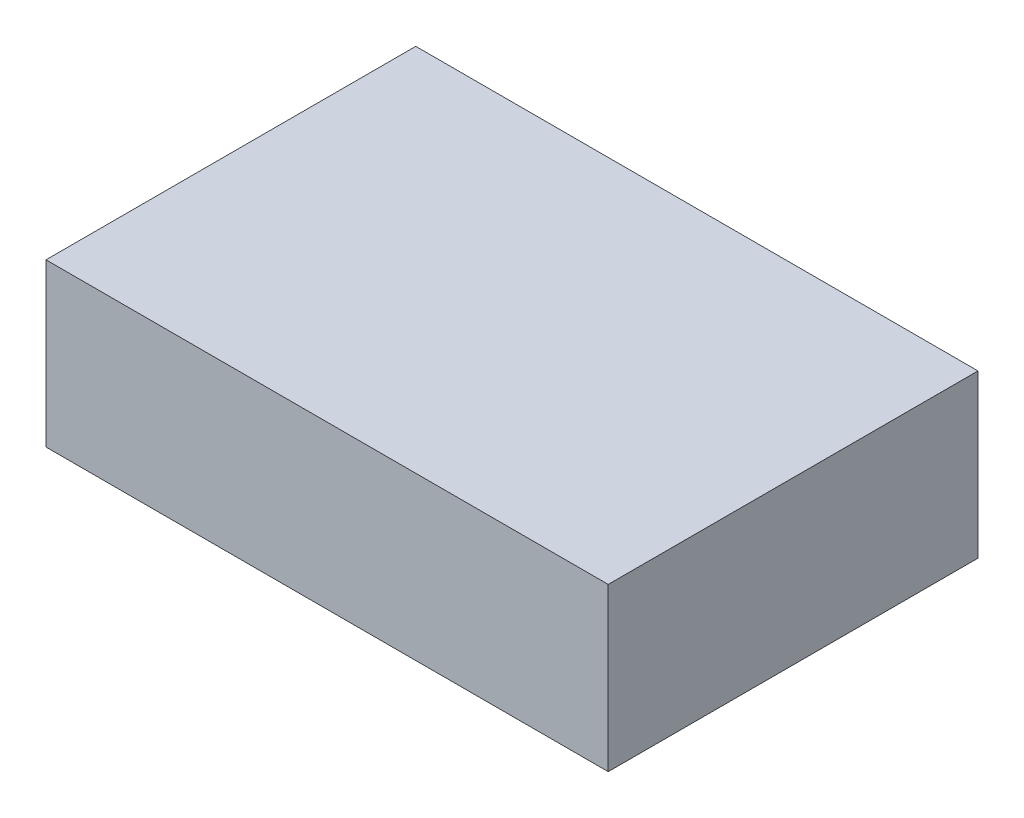
ISO-10303-21;
HEADER;
FILE_DESCRIPTION(('STEP AP214'),'2;1');
FILE_NAME('part.step','',(''),(''),'','','');
FILE_SCHEMA(('AUTOMOTIVE_DESIGN { 1 0 10303 214 1 1 1 1 }'));
ENDSEC;
DATA;
#1=APPLICATION_CONTEXT('core data for automotive mechanical design processes');
#2=APPLICATION_PROTOCOL_DEFINITION('international standard','automotive_design',2000,#1);
#3=PRODUCT_CONTEXT('',#1,'mechanical');
#4=PRODUCT('Part','Part','',(#3));
#5=PRODUCT_RELATED_PRODUCT_CATEGORY('part','',(#4));
#6=PRODUCT_DEFINITION_FORMATION('','',#4);
#7=PRODUCT_DEFINITION_CONTEXT('part definition',#1,'design');
#8=PRODUCT_DEFINITION('design','',#6,#7);
#9=PRODUCT_DEFINITION_SHAPE('','',#8);
#10=(LENGTH_UNIT() NAMED_UNIT(*) SI_UNIT(.MILLI.,.METRE.));
#11=(NAMED_UNIT(*) PLANE_ANGLE_UNIT() SI_UNIT($,.RADIAN.));
#12=(NAMED_UNIT(*) SI_UNIT($,.STERADIAN.) SOLID_ANGLE_UNIT());
#13=UNCERTAINTY_MEASURE_WITH_UNIT(LENGTH_MEASURE(1.E-05),#10,'distance_accuracy_value','');
#14=(GEOMETRIC_REPRESENTATION_CONTEXT(3) GLOBAL_UNCERTAINTY_ASSIGNED_CONTEXT((#13)) GLOBAL_UNIT_ASSIGNED_CONTEXT((#10,
#11,#12)) REPRESENTATION_CONTEXT('',''));
#15=CARTESIAN_POINT('',(0.,0.,0.));
#16=DIRECTION('',(0.,0.,1.));
#17=DIRECTION('',(1.,0.,0.));
#18=AXIS2_PLACEMENT_3D('',#15,#16,#17);
#19=CARTESIAN_POINT('',(-0.65000124,0.18750026,0.));
#20=DIRECTION('',(0.,1.,0.));
#21=DIRECTION('',(0.,0.,1.));
#22=AXIS2_PLACEMENT_3D('',#19,#20,#21);
#23=PLANE('',#22);
#24=DIRECTION('',(0.,0.,-1.));
#25=VECTOR('',#24,1.);
#26=CARTESIAN_POINT('',(0.65000124,0.18750026,0.));
#27=LINE('',#26,#25);
#28=CARTESIAN_POINT('',(0.65000124,0.18750026,0.));
#29=VERTEX_POINT('',#28);
#30=CARTESIAN_POINT('',(0.65000124,0.18750026,0.85499956));
#31=VERTEX_POINT('',#30);
#32=EDGE_CURVE('E20',#29,#31,#27,.F.);
#33=ORIENTED_EDGE('',*,*,#32,.F.);
#34=DIRECTION('',(1.,0.,0.));
#35=VECTOR('',#34,1.);
#36=CARTESIAN_POINT('',(0.65000124,0.18750026,0.));
#37=LINE('',#36,#35);
#38=CARTESIAN_POINT('',(-0.65000124,0.18750026,0.));
#39=VERTEX_POINT('',#38);
#40=EDGE_CURVE('E80',#29,#39,#37,.F.);
#41=ORIENTED_EDGE('',*,*,#40,.T.);
#42=DIRECTION('',(0.,0.,1.));
#43=VECTOR('',#42,1.);
#44=CARTESIAN_POINT('',(-0.65000124,0.18750026,0.));
#45=LINE('',#44,#43);
#46=CARTESIAN_POINT('',(-0.65000124,0.18750026,0.85499956));
#47=VERTEX_POINT('',#46);
#48=EDGE_CURVE('E68',#47,#39,#45,.F.);
#49=ORIENTED_EDGE('',*,*,#48,.F.);
#50=DIRECTION('',(1.,0.,0.));
#51=VECTOR('',#50,1.);
#52=CARTESIAN_POINT('',(0.65000124,0.18750026,0.85499956));
#53=LINE('',#52,#51);
#54=EDGE_CURVE('E56',#31,#47,#53,.F.);
#55=ORIENTED_EDGE('',*,*,#54,.F.);
#56=EDGE_LOOP('',(#33,#41,#49,#55));
#57=FACE_BOUND('',#56,.T.);
#58=ADVANCED_FACE('F17',(#57),#23,.T.);
#59=CARTESIAN_POINT('',(0.65000124,0.18750026,0.));
#60=DIRECTION('',(1.,0.,0.));
#61=DIRECTION('',(0.,0.,-1.));
#62=AXIS2_PLACEMENT_3D('',#59,#60,#61);
#63=PLANE('',#62);
#64=DIRECTION('',(0.,0.,-1.));
#65=VECTOR('',#64,1.);
#66=CARTESIAN_POINT('',(0.65000124,-0.18750026,0.));
#67=LINE('',#66,#65);
#68=CARTESIAN_POINT('',(0.65000124,-0.18750026,0.));
#69=VERTEX_POINT('',#68);
#70=CARTESIAN_POINT('',(0.65000124,-0.18750026,0.85499956));
#71=VERTEX_POINT('',#70);
#72=EDGE_CURVE('E83',#69,#71,#67,.F.);
#73=ORIENTED_EDGE('',*,*,#72,.F.);
#74=DIRECTION('',(0.,1.,0.));
#75=VECTOR('',#74,1.);
#76=CARTESIAN_POINT('',(0.65000124,-0.18750026,0.));
#77=LINE('',#76,#75);
#78=EDGE_CURVE('E65',#69,#29,#77,.T.);
#79=ORIENTED_EDGE('',*,*,#78,.T.);
#80=ORIENTED_EDGE('',*,*,#32,.T.);
#81=DIRECTION('',(0.,1.,0.));
#82=VECTOR('',#81,1.);
#83=CARTESIAN_POINT('',(0.65000124,-0.18750026,0.85499956));
#84=LINE('',#83,#82);
#85=EDGE_CURVE('E62',#71,#31,#84,.T.);
#86=ORIENTED_EDGE('',*,*,#85,.F.);
#87=EDGE_LOOP('',(#73,#79,#80,#86));
#88=FACE_BOUND('',#87,.T.);
#89=ADVANCED_FACE('F61',(#88),#63,.T.);
#90=CARTESIAN_POINT('',(0.65000124,-0.18750026,0.85499956));
#91=DIRECTION('',(0.,0.,1.));
#92=DIRECTION('',(1.,0.,0.));
#93=AXIS2_PLACEMENT_3D('',#90,#91,#92);
#94=PLANE('',#93);
#95=DIRECTION('',(0.,1.,0.));
#96=VECTOR('',#95,1.);
#97=CARTESIAN_POINT('',(-0.65000124,-0.18750026,0.85499956));
#98=LINE('',#97,#96);
#99=CARTESIAN_POINT('',(-0.65000124,-0.18750026,0.85499956));
#100=VERTEX_POINT('',#99);
#101=EDGE_CURVE('E70',#100,#47,#98,.T.);
#102=ORIENTED_EDGE('',*,*,#101,.F.);
#103=DIRECTION('',(1.,0.,0.));
#104=VECTOR('',#103,1.);
#105=CARTESIAN_POINT('',(0.65000124,-0.18750026,0.85499956));
#106=LINE('',#105,#104);
#107=EDGE_CURVE('E74',#71,#100,#106,.F.);
#108=ORIENTED_EDGE('',*,*,#107,.F.);
#109=ORIENTED_EDGE('',*,*,#85,.T.);
#110=ORIENTED_EDGE('',*,*,#54,.T.);
#111=EDGE_LOOP('',(#102,#108,#109,#110));
#112=FACE_BOUND('',#111,.T.);
#113=ADVANCED_FACE('F72',(#112),#94,.T.);
#114=CARTESIAN_POINT('',(-0.65000124,-0.18750026,0.));
#115=DIRECTION('',(-1.,0.,0.));
#116=DIRECTION('',(0.,0.,1.));
#117=AXIS2_PLACEMENT_3D('',#114,#115,#116);
#118=PLANE('',#117);
#119=ORIENTED_EDGE('',*,*,#48,.T.);
#120=DIRECTION('',(0.,1.,0.));
#121=VECTOR('',#120,1.);
#122=CARTESIAN_POINT('',(-0.65000124,-0.18750026,0.));
#123=LINE('',#122,#121);
#124=CARTESIAN_POINT('',(-0.65000124,-0.18750026,0.));
#125=VERTEX_POINT('',#124);
#126=EDGE_CURVE('E35',#39,#125,#123,.F.);
#127=ORIENTED_EDGE('',*,*,#126,.T.);
#128=DIRECTION('',(0.,0.,-1.));
#129=VECTOR('',#128,1.);
#130=CARTESIAN_POINT('',(-0.65000124,-0.18750026,0.));
#131=LINE('',#130,#129);
#132=EDGE_CURVE('E26',#100,#125,#131,.T.);
#133=ORIENTED_EDGE('',*,*,#132,.F.);
#134=ORIENTED_EDGE('',*,*,#101,.T.);
#135=EDGE_LOOP('',(#119,#127,#133,#134));
#136=FACE_BOUND('',#135,.T.);
#137=ADVANCED_FACE('F89',(#136),#118,.T.);
#138=CARTESIAN_POINT('',(0.65000124,-0.18750026,0.));
#139=DIRECTION('',(0.,0.,1.));
#140=DIRECTION('',(1.,0.,0.));
#141=AXIS2_PLACEMENT_3D('',#138,#139,#140);
#142=PLANE('',#141);
#143=ORIENTED_EDGE('',*,*,#126,.F.);
#144=ORIENTED_EDGE('',*,*,#40,.F.);
#145=ORIENTED_EDGE('',*,*,#78,.F.);
#146=DIRECTION('',(1.,0.,0.));
#147=VECTOR('',#146,1.);
#148=CARTESIAN_POINT('',(0.65000124,-0.18750026,0.));
#149=LINE('',#148,#147);
#150=EDGE_CURVE('E11',#125,#69,#149,.T.);
#151=ORIENTED_EDGE('',*,*,#150,.F.);
#152=EDGE_LOOP('',(#143,#144,#145,#151));
#153=FACE_BOUND('',#152,.T.);
#154=ADVANCED_FACE('F91',(#153),#142,.F.);
#155=CARTESIAN_POINT('',(0.65000124,-0.18750026,0.));
#156=DIRECTION('',(0.,-1.,0.));
#157=DIRECTION('',(0.,0.,-1.));
#158=AXIS2_PLACEMENT_3D('',#155,#156,#157);
#159=PLANE('',#158);
#160=ORIENTED_EDGE('',*,*,#132,.T.);
#161=ORIENTED_EDGE('',*,*,#150,.T.);
#162=ORIENTED_EDGE('',*,*,#72,.T.);
#163=ORIENTED_EDGE('',*,*,#107,.T.);
#164=EDGE_LOOP('',(#160,#161,#162,#163));
#165=FACE_BOUND('',#164,.T.);
#166=ADVANCED_FACE('F88',(#165),#159,.T.);
#167=CLOSED_SHELL('',(#58,#89,#113,#137,#154,#166));
#168=MANIFOLD_SOLID_BREP('B1',#167);
#169=ADVANCED_BREP_SHAPE_REPRESENTATION('',(#18,#168),#14);
#170=SHAPE_DEFINITION_REPRESENTATION(#9,#169);
ENDSEC;
END-ISO-10303-21;
